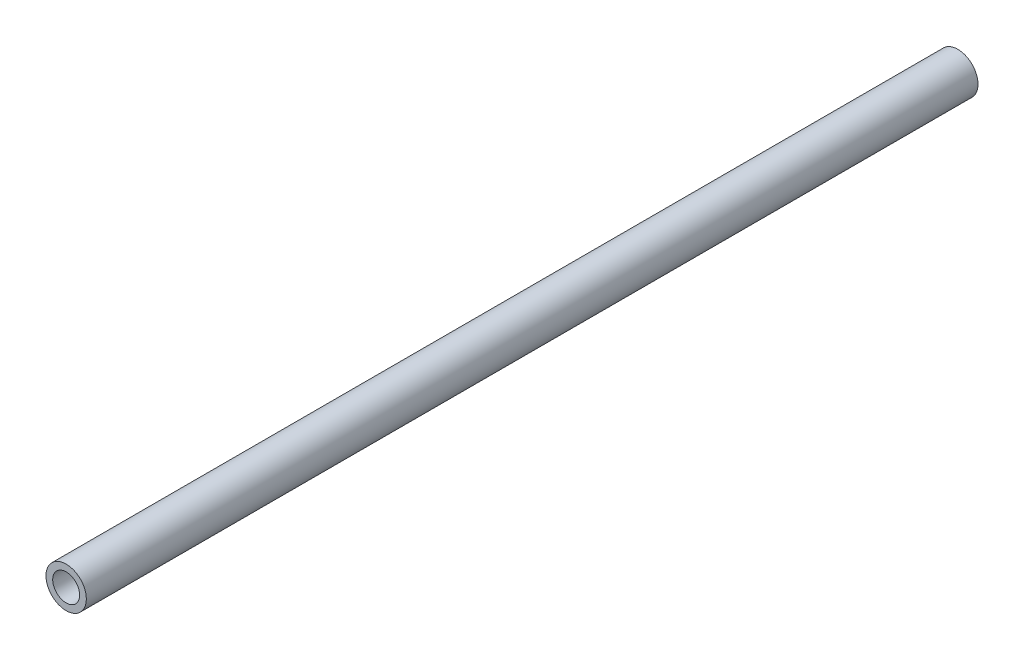
ISO-10303-21;
HEADER;
FILE_DESCRIPTION(('STEP AP214'),'2;1');
FILE_NAME('part.step','',(''),(''),'','','');
FILE_SCHEMA(('AUTOMOTIVE_DESIGN { 1 0 10303 214 1 1 1 1 }'));
ENDSEC;
DATA;
#1=APPLICATION_CONTEXT('core data for automotive mechanical design processes');
#2=APPLICATION_PROTOCOL_DEFINITION('international standard','automotive_design',2000,#1);
#3=PRODUCT_CONTEXT('',#1,'mechanical');
#4=PRODUCT('Part','Part','',(#3));
#5=PRODUCT_RELATED_PRODUCT_CATEGORY('part','',(#4));
#6=PRODUCT_DEFINITION_FORMATION('','',#4);
#7=PRODUCT_DEFINITION_CONTEXT('part definition',#1,'design');
#8=PRODUCT_DEFINITION('design','',#6,#7);
#9=PRODUCT_DEFINITION_SHAPE('','',#8);
#10=(LENGTH_UNIT() NAMED_UNIT(*) SI_UNIT(.MILLI.,.METRE.));
#11=(NAMED_UNIT(*) PLANE_ANGLE_UNIT() SI_UNIT($,.RADIAN.));
#12=(NAMED_UNIT(*) SI_UNIT($,.STERADIAN.) SOLID_ANGLE_UNIT());
#13=UNCERTAINTY_MEASURE_WITH_UNIT(LENGTH_MEASURE(1.E-05),#10,'distance_accuracy_value','');
#14=(GEOMETRIC_REPRESENTATION_CONTEXT(3) GLOBAL_UNCERTAINTY_ASSIGNED_CONTEXT((#13)) GLOBAL_UNIT_ASSIGNED_CONTEXT((#10,
#11,#12)) REPRESENTATION_CONTEXT('',''));
#15=CARTESIAN_POINT('',(0.,0.,0.));
#16=DIRECTION('',(0.,0.,1.));
#17=DIRECTION('',(1.,0.,0.));
#18=AXIS2_PLACEMENT_3D('',#15,#16,#17);
#19=CARTESIAN_POINT('',(0.,0.,336.55));
#20=DIRECTION('',(0.,0.,1.));
#21=DIRECTION('',(1.,0.,0.));
#22=AXIS2_PLACEMENT_3D('',#19,#20,#21);
#23=PLANE('',#22);
#24=CARTESIAN_POINT('',(0.,0.,336.55));
#25=DIRECTION('',(0.,0.,1.));
#26=DIRECTION('',(1.,0.,0.));
#27=AXIS2_PLACEMENT_3D('',#24,#25,#26);
#28=CIRCLE('',#27,7.62);
#29=CARTESIAN_POINT('',(7.62,0.,336.55));
#30=VERTEX_POINT('',#29);
#31=EDGE_CURVE('E10',#30,#30,#28,.T.);
#32=ORIENTED_EDGE('',*,*,#31,.T.);
#33=EDGE_LOOP('',(#32));
#34=FACE_BOUND('',#33,.T.);
#35=CARTESIAN_POINT('',(0.,0.,336.55));
#36=DIRECTION('',(0.,0.,1.));
#37=DIRECTION('',(1.,0.,0.));
#38=AXIS2_PLACEMENT_3D('',#35,#36,#37);
#39=CIRCLE('',#38,5.08);
#40=CARTESIAN_POINT('',(5.08,0.,336.55));
#41=VERTEX_POINT('',#40);
#42=EDGE_CURVE('E41',#41,#41,#39,.T.);
#43=ORIENTED_EDGE('',*,*,#42,.F.);
#44=EDGE_LOOP('',(#43));
#45=FACE_BOUND('',#44,.T.);
#46=ADVANCED_FACE('F30',(#34,#45),#23,.T.);
#47=CARTESIAN_POINT('',(0.,0.,0.));
#48=DIRECTION('',(0.,0.,1.));
#49=DIRECTION('',(1.,0.,0.));
#50=AXIS2_PLACEMENT_3D('',#47,#48,#49);
#51=PLANE('',#50);
#52=CARTESIAN_POINT('',(0.,0.,0.));
#53=DIRECTION('',(0.,0.,1.));
#54=DIRECTION('',(1.,0.,0.));
#55=AXIS2_PLACEMENT_3D('',#52,#53,#54);
#56=CIRCLE('',#55,7.62);
#57=CARTESIAN_POINT('',(7.62,0.,0.));
#58=VERTEX_POINT('',#57);
#59=EDGE_CURVE('E34',#58,#58,#56,.T.);
#60=ORIENTED_EDGE('',*,*,#59,.F.);
#61=EDGE_LOOP('',(#60));
#62=FACE_BOUND('',#61,.T.);
#63=CARTESIAN_POINT('',(0.,0.,0.));
#64=DIRECTION('',(0.,0.,1.));
#65=DIRECTION('',(1.,0.,0.));
#66=AXIS2_PLACEMENT_3D('',#63,#64,#65);
#67=CIRCLE('',#66,5.08);
#68=CARTESIAN_POINT('',(5.08,0.,0.));
#69=VERTEX_POINT('',#68);
#70=EDGE_CURVE('E43',#69,#69,#67,.T.);
#71=ORIENTED_EDGE('',*,*,#70,.T.);
#72=EDGE_LOOP('',(#71));
#73=FACE_BOUND('',#72,.T.);
#74=ADVANCED_FACE('F53',(#62,#73),#51,.F.);
#75=CARTESIAN_POINT('',(0.,0.,336.55));
#76=DIRECTION('',(0.,0.,-1.));
#77=DIRECTION('',(-1.,0.,0.));
#78=AXIS2_PLACEMENT_3D('',#75,#76,#77);
#79=CYLINDRICAL_SURFACE('',#78,7.62);
#80=ORIENTED_EDGE('',*,*,#31,.F.);
#81=EDGE_LOOP('',(#80));
#82=FACE_BOUND('',#81,.T.);
#83=ORIENTED_EDGE('',*,*,#59,.T.);
#84=EDGE_LOOP('',(#83));
#85=FACE_BOUND('',#84,.T.);
#86=ADVANCED_FACE('F32',(#82,#85),#79,.T.);
#87=CARTESIAN_POINT('',(0.,0.,336.55));
#88=DIRECTION('',(0.,0.,-1.));
#89=DIRECTION('',(-1.,0.,0.));
#90=AXIS2_PLACEMENT_3D('',#87,#88,#89);
#91=CYLINDRICAL_SURFACE('',#90,5.08);
#92=ORIENTED_EDGE('',*,*,#42,.T.);
#93=EDGE_LOOP('',(#92));
#94=FACE_BOUND('',#93,.T.);
#95=ORIENTED_EDGE('',*,*,#70,.F.);
#96=EDGE_LOOP('',(#95));
#97=FACE_BOUND('',#96,.T.);
#98=ADVANCED_FACE('F49',(#94,#97),#91,.F.);
#99=CLOSED_SHELL('',(#46,#74,#86,#98));
#100=MANIFOLD_SOLID_BREP('B2',#99);
#101=ADVANCED_BREP_SHAPE_REPRESENTATION('',(#18,#100),#14);
#102=SHAPE_DEFINITION_REPRESENTATION(#9,#101);
ENDSEC;
END-ISO-10303-21;
